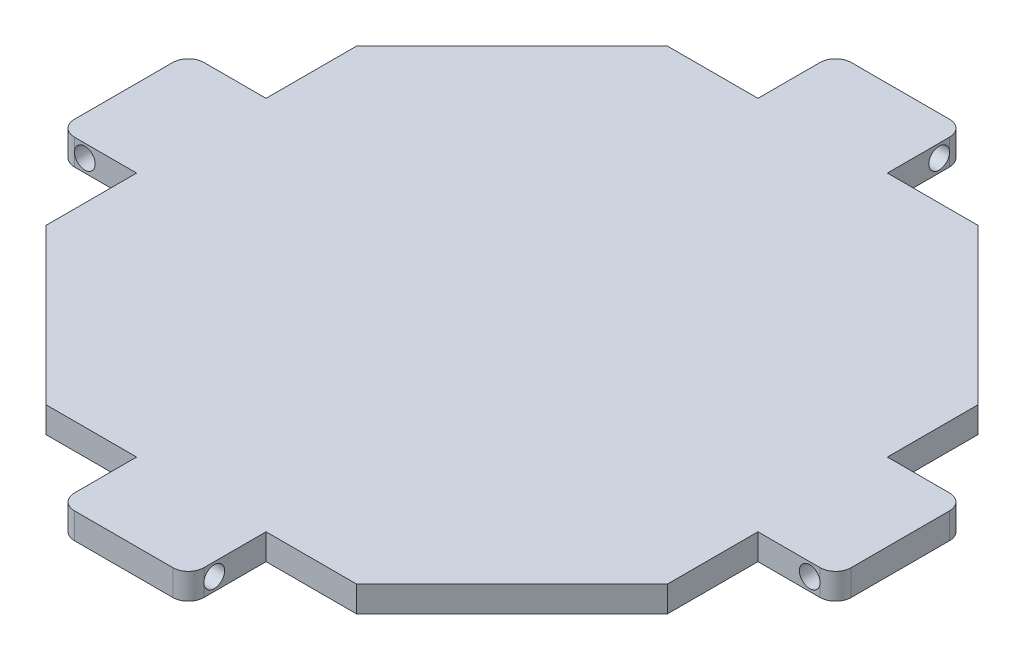
ISO-10303-21;
HEADER;
FILE_DESCRIPTION(('STEP AP214'),'2;1');
FILE_NAME('part.step','',(''),(''),'','','');
FILE_SCHEMA(('AUTOMOTIVE_DESIGN { 1 0 10303 214 1 1 1 1 }'));
ENDSEC;
DATA;
#1=APPLICATION_CONTEXT('core data for automotive mechanical design processes');
#2=APPLICATION_PROTOCOL_DEFINITION('international standard','automotive_design',2000,#1);
#3=PRODUCT_CONTEXT('',#1,'mechanical');
#4=PRODUCT('Part','Part','',(#3));
#5=PRODUCT_RELATED_PRODUCT_CATEGORY('part','',(#4));
#6=PRODUCT_DEFINITION_FORMATION('','',#4);
#7=PRODUCT_DEFINITION_CONTEXT('part definition',#1,'design');
#8=PRODUCT_DEFINITION('design','',#6,#7);
#9=PRODUCT_DEFINITION_SHAPE('','',#8);
#10=(LENGTH_UNIT() NAMED_UNIT(*) SI_UNIT(.MILLI.,.METRE.));
#11=(NAMED_UNIT(*) PLANE_ANGLE_UNIT() SI_UNIT($,.RADIAN.));
#12=(NAMED_UNIT(*) SI_UNIT($,.STERADIAN.) SOLID_ANGLE_UNIT());
#13=UNCERTAINTY_MEASURE_WITH_UNIT(LENGTH_MEASURE(1.E-05),#10,'distance_accuracy_value','');
#14=(GEOMETRIC_REPRESENTATION_CONTEXT(3) GLOBAL_UNCERTAINTY_ASSIGNED_CONTEXT((#13)) GLOBAL_UNIT_ASSIGNED_CONTEXT((#10,
#11,#12)) REPRESENTATION_CONTEXT('',''));
#15=CARTESIAN_POINT('',(0.,0.,0.));
#16=DIRECTION('',(0.,0.,1.));
#17=DIRECTION('',(1.,0.,0.));
#18=AXIS2_PLACEMENT_3D('',#15,#16,#17);
#19=CARTESIAN_POINT('',(-60.,5.,0.));
#20=DIRECTION('',(1.,0.,0.));
#21=DIRECTION('',(0.,0.,-1.));
#22=AXIS2_PLACEMENT_3D('',#19,#20,#21);
#23=PLANE('',#22);
#24=DIRECTION('',(0.,0.,1.));
#25=VECTOR('',#24,1.);
#26=CARTESIAN_POINT('',(-60.,0.,0.));
#27=LINE('',#26,#25);
#28=CARTESIAN_POINT('',(-60.,0.,-30.));
#29=VERTEX_POINT('',#28);
#30=CARTESIAN_POINT('',(-60.,0.,-12.5));
#31=VERTEX_POINT('',#30);
#32=EDGE_CURVE('E294',#29,#31,#27,.T.);
#33=ORIENTED_EDGE('',*,*,#32,.T.);
#34=DIRECTION('',(0.,-1.,0.));
#35=VECTOR('',#34,1.);
#36=CARTESIAN_POINT('',(-60.,5.,-12.5));
#37=LINE('',#36,#35);
#38=CARTESIAN_POINT('',(-60.,5.,-12.5));
#39=VERTEX_POINT('',#38);
#40=EDGE_CURVE('E272',#39,#31,#37,.T.);
#41=ORIENTED_EDGE('',*,*,#40,.F.);
#42=DIRECTION('',(0.,0.,1.));
#43=VECTOR('',#42,1.);
#44=CARTESIAN_POINT('',(-60.,5.,0.));
#45=LINE('',#44,#43);
#46=CARTESIAN_POINT('',(-60.,5.,-30.));
#47=VERTEX_POINT('',#46);
#48=EDGE_CURVE('E280',#47,#39,#45,.T.);
#49=ORIENTED_EDGE('',*,*,#48,.F.);
#50=DIRECTION('',(0.,-1.,0.));
#51=VECTOR('',#50,1.);
#52=CARTESIAN_POINT('',(-60.,5.,-30.));
#53=LINE('',#52,#51);
#54=EDGE_CURVE('E448',#47,#29,#53,.T.);
#55=ORIENTED_EDGE('',*,*,#54,.T.);
#56=EDGE_LOOP('',(#33,#41,#49,#55));
#57=FACE_BOUND('',#56,.T.);
#58=ADVANCED_FACE('F35',(#57),#23,.F.);
#59=CARTESIAN_POINT('',(0.,5.,-12.5));
#60=DIRECTION('',(0.,0.,1.));
#61=DIRECTION('',(1.,0.,0.));
#62=AXIS2_PLACEMENT_3D('',#59,#60,#61);
#63=PLANE('',#62);
#64=DIRECTION('',(0.,-1.,0.));
#65=VECTOR('',#64,1.);
#66=CARTESIAN_POINT('',(-72.,5.,-12.5));
#67=LINE('',#66,#65);
#68=CARTESIAN_POINT('',(-72.,0.,-12.5));
#69=VERTEX_POINT('',#68);
#70=CARTESIAN_POINT('',(-72.,2.5,-12.5));
#71=VERTEX_POINT('',#70);
#72=EDGE_CURVE('E377',#69,#71,#67,.F.);
#73=ORIENTED_EDGE('',*,*,#72,.T.);
#74=CARTESIAN_POINT('',(-70.,2.5,-12.5));
#75=DIRECTION('',(0.,0.,1.));
#76=DIRECTION('',(1.,0.,0.));
#77=AXIS2_PLACEMENT_3D('',#74,#75,#76);
#78=CIRCLE('',#77,2.);
#79=EDGE_CURVE('E544',#71,#71,#78,.T.);
#80=ORIENTED_EDGE('',*,*,#79,.T.);
#81=CARTESIAN_POINT('',(-72.,5.,-12.5));
#82=VERTEX_POINT('',#81);
#83=EDGE_CURVE('E276',#71,#82,#67,.F.);
#84=ORIENTED_EDGE('',*,*,#83,.T.);
#85=DIRECTION('',(-1.,0.,0.));
#86=VECTOR('',#85,1.);
#87=CARTESIAN_POINT('',(0.,5.,-12.5));
#88=LINE('',#87,#86);
#89=EDGE_CURVE('E266',#39,#82,#88,.T.);
#90=ORIENTED_EDGE('',*,*,#89,.F.);
#91=ORIENTED_EDGE('',*,*,#40,.T.);
#92=DIRECTION('',(-1.,0.,0.));
#93=VECTOR('',#92,1.);
#94=CARTESIAN_POINT('',(0.,0.,-12.5));
#95=LINE('',#94,#93);
#96=EDGE_CURVE('E404',#31,#69,#95,.T.);
#97=ORIENTED_EDGE('',*,*,#96,.T.);
#98=EDGE_LOOP('',(#73,#80,#84,#90,#91,#97));
#99=FACE_BOUND('',#98,.T.);
#100=ADVANCED_FACE('F269',(#99),#63,.F.);
#101=CARTESIAN_POINT('',(-75.,5.,0.));
#102=DIRECTION('',(1.,0.,0.));
#103=DIRECTION('',(0.,0.,-1.));
#104=AXIS2_PLACEMENT_3D('',#101,#102,#103);
#105=PLANE('',#104);
#106=DIRECTION('',(0.,0.,1.));
#107=VECTOR('',#106,1.);
#108=CARTESIAN_POINT('',(-75.,5.,0.));
#109=LINE('',#108,#107);
#110=CARTESIAN_POINT('',(-75.,5.,-9.49999999999998));
#111=VERTEX_POINT('',#110);
#112=CARTESIAN_POINT('',(-75.,5.,9.50000000000003));
#113=VERTEX_POINT('',#112);
#114=EDGE_CURVE('E279',#111,#113,#109,.T.);
#115=ORIENTED_EDGE('',*,*,#114,.F.);
#116=DIRECTION('',(0.,-1.,0.));
#117=VECTOR('',#116,1.);
#118=CARTESIAN_POINT('',(-75.,5.,-9.49999999999998));
#119=LINE('',#118,#117);
#120=CARTESIAN_POINT('',(-75.,0.,-9.49999999999998));
#121=VERTEX_POINT('',#120);
#122=EDGE_CURVE('E375',#111,#121,#119,.T.);
#123=ORIENTED_EDGE('',*,*,#122,.T.);
#124=DIRECTION('',(0.,0.,1.));
#125=VECTOR('',#124,1.);
#126=CARTESIAN_POINT('',(-75.,0.,0.));
#127=LINE('',#126,#125);
#128=CARTESIAN_POINT('',(-75.,0.,9.50000000000003));
#129=VERTEX_POINT('',#128);
#130=EDGE_CURVE('E400',#121,#129,#127,.T.);
#131=ORIENTED_EDGE('',*,*,#130,.T.);
#132=DIRECTION('',(0.,-1.,0.));
#133=VECTOR('',#132,1.);
#134=CARTESIAN_POINT('',(-75.,5.,9.50000000000003));
#135=LINE('',#134,#133);
#136=EDGE_CURVE('E373',#129,#113,#135,.F.);
#137=ORIENTED_EDGE('',*,*,#136,.T.);
#138=EDGE_LOOP('',(#115,#123,#131,#137));
#139=FACE_BOUND('',#138,.T.);
#140=ADVANCED_FACE('F551',(#139),#105,.F.);
#141=CARTESIAN_POINT('',(0.,5.,12.5));
#142=DIRECTION('',(0.,0.,-1.));
#143=DIRECTION('',(-1.,0.,0.));
#144=AXIS2_PLACEMENT_3D('',#141,#142,#143);
#145=PLANE('',#144);
#146=DIRECTION('',(0.,-1.,0.));
#147=VECTOR('',#146,1.);
#148=CARTESIAN_POINT('',(-72.,5.,12.5));
#149=LINE('',#148,#147);
#150=CARTESIAN_POINT('',(-72.,5.,12.5));
#151=VERTEX_POINT('',#150);
#152=CARTESIAN_POINT('',(-72.,2.5,12.5));
#153=VERTEX_POINT('',#152);
#154=EDGE_CURVE('E11',#151,#153,#149,.T.);
#155=ORIENTED_EDGE('',*,*,#154,.T.);
#156=CARTESIAN_POINT('',(-70.,2.5,12.5));
#157=DIRECTION('',(0.,0.,1.));
#158=DIRECTION('',(1.,0.,0.));
#159=AXIS2_PLACEMENT_3D('',#156,#157,#158);
#160=CIRCLE('',#159,2.);
#161=EDGE_CURVE('E387',#153,#153,#160,.T.);
#162=ORIENTED_EDGE('',*,*,#161,.F.);
#163=CARTESIAN_POINT('',(-72.,0.,12.5));
#164=VERTEX_POINT('',#163);
#165=EDGE_CURVE('E43',#153,#164,#149,.T.);
#166=ORIENTED_EDGE('',*,*,#165,.T.);
#167=DIRECTION('',(1.,0.,0.));
#168=VECTOR('',#167,1.);
#169=CARTESIAN_POINT('',(0.,0.,12.5));
#170=LINE('',#169,#168);
#171=CARTESIAN_POINT('',(-60.,0.,12.5));
#172=VERTEX_POINT('',#171);
#173=EDGE_CURVE('E386',#164,#172,#170,.T.);
#174=ORIENTED_EDGE('',*,*,#173,.T.);
#175=DIRECTION('',(0.,-1.,0.));
#176=VECTOR('',#175,1.);
#177=CARTESIAN_POINT('',(-60.,5.,12.5));
#178=LINE('',#177,#176);
#179=CARTESIAN_POINT('',(-60.,5.,12.5));
#180=VERTEX_POINT('',#179);
#181=EDGE_CURVE('E296',#180,#172,#178,.T.);
#182=ORIENTED_EDGE('',*,*,#181,.F.);
#183=DIRECTION('',(1.,0.,0.));
#184=VECTOR('',#183,1.);
#185=CARTESIAN_POINT('',(0.,5.,12.5));
#186=LINE('',#185,#184);
#187=EDGE_CURVE('E552',#151,#180,#186,.T.);
#188=ORIENTED_EDGE('',*,*,#187,.F.);
#189=EDGE_LOOP('',(#155,#162,#166,#174,#182,#188));
#190=FACE_BOUND('',#189,.T.);
#191=ADVANCED_FACE('F383',(#190),#145,.F.);
#192=CARTESIAN_POINT('',(-60.,0.,30.));
#193=VERTEX_POINT('',#192);
#194=EDGE_CURVE('E399',#172,#193,#27,.T.);
#195=ORIENTED_EDGE('',*,*,#194,.T.);
#196=DIRECTION('',(0.,-1.,0.));
#197=VECTOR('',#196,1.);
#198=CARTESIAN_POINT('',(-60.,5.,30.));
#199=LINE('',#198,#197);
#200=CARTESIAN_POINT('',(-60.,5.,30.));
#201=VERTEX_POINT('',#200);
#202=EDGE_CURVE('E301',#201,#193,#199,.T.);
#203=ORIENTED_EDGE('',*,*,#202,.F.);
#204=EDGE_CURVE('E292',#180,#201,#45,.T.);
#205=ORIENTED_EDGE('',*,*,#204,.F.);
#206=ORIENTED_EDGE('',*,*,#181,.T.);
#207=EDGE_LOOP('',(#195,#203,#205,#206));
#208=FACE_BOUND('',#207,.T.);
#209=ADVANCED_FACE('F607',(#208),#23,.F.);
#210=CARTESIAN_POINT('',(-45.,5.,45.));
#211=DIRECTION('',(0.707106781186547,0.,-0.707106781186548));
#212=DIRECTION('',(-0.707106781186548,0.,-0.707106781186547));
#213=AXIS2_PLACEMENT_3D('',#210,#211,#212);
#214=PLANE('',#213);
#215=DIRECTION('',(0.707106781186548,0.,0.707106781186547));
#216=VECTOR('',#215,1.);
#217=CARTESIAN_POINT('',(-45.,0.,45.));
#218=LINE('',#217,#216);
#219=CARTESIAN_POINT('',(-30.,0.,60.));
#220=VERTEX_POINT('',#219);
#221=EDGE_CURVE('E402',#193,#220,#218,.T.);
#222=ORIENTED_EDGE('',*,*,#221,.T.);
#223=DIRECTION('',(0.,-1.,0.));
#224=VECTOR('',#223,1.);
#225=CARTESIAN_POINT('',(-30.,5.,60.));
#226=LINE('',#225,#224);
#227=CARTESIAN_POINT('',(-30.,5.,60.));
#228=VERTEX_POINT('',#227);
#229=EDGE_CURVE('E482',#228,#220,#226,.T.);
#230=ORIENTED_EDGE('',*,*,#229,.F.);
#231=DIRECTION('',(0.707106781186548,0.,0.707106781186547));
#232=VECTOR('',#231,1.);
#233=CARTESIAN_POINT('',(-45.,5.,45.));
#234=LINE('',#233,#232);
#235=EDGE_CURVE('E490',#201,#228,#234,.T.);
#236=ORIENTED_EDGE('',*,*,#235,.F.);
#237=ORIENTED_EDGE('',*,*,#202,.T.);
#238=EDGE_LOOP('',(#222,#230,#236,#237));
#239=FACE_BOUND('',#238,.T.);
#240=ADVANCED_FACE('F488',(#239),#214,.F.);
#241=CARTESIAN_POINT('',(0.,5.,60.));
#242=DIRECTION('',(0.,0.,-1.));
#243=DIRECTION('',(-1.,0.,0.));
#244=AXIS2_PLACEMENT_3D('',#241,#242,#243);
#245=PLANE('',#244);
#246=DIRECTION('',(1.,0.,0.));
#247=VECTOR('',#246,1.);
#248=CARTESIAN_POINT('',(0.,0.,60.));
#249=LINE('',#248,#247);
#250=CARTESIAN_POINT('',(-12.5,0.,60.));
#251=VERTEX_POINT('',#250);
#252=EDGE_CURVE('E409',#220,#251,#249,.T.);
#253=ORIENTED_EDGE('',*,*,#252,.T.);
#254=DIRECTION('',(0.,-1.,0.));
#255=VECTOR('',#254,1.);
#256=CARTESIAN_POINT('',(-12.5,5.,60.));
#257=LINE('',#256,#255);
#258=CARTESIAN_POINT('',(-12.5,5.,60.));
#259=VERTEX_POINT('',#258);
#260=EDGE_CURVE('E479',#259,#251,#257,.T.);
#261=ORIENTED_EDGE('',*,*,#260,.F.);
#262=DIRECTION('',(1.,0.,0.));
#263=VECTOR('',#262,1.);
#264=CARTESIAN_POINT('',(0.,5.,60.));
#265=LINE('',#264,#263);
#266=EDGE_CURVE('E508',#228,#259,#265,.T.);
#267=ORIENTED_EDGE('',*,*,#266,.F.);
#268=ORIENTED_EDGE('',*,*,#229,.T.);
#269=EDGE_LOOP('',(#253,#261,#267,#268));
#270=FACE_BOUND('',#269,.T.);
#271=ADVANCED_FACE('F497',(#270),#245,.F.);
#272=CARTESIAN_POINT('',(-12.5,5.,0.));
#273=DIRECTION('',(1.,0.,0.));
#274=DIRECTION('',(0.,0.,-1.));
#275=AXIS2_PLACEMENT_3D('',#272,#273,#274);
#276=PLANE('',#275);
#277=DIRECTION('',(0.,-1.,0.));
#278=VECTOR('',#277,1.);
#279=CARTESIAN_POINT('',(-12.5,5.,72.));
#280=LINE('',#279,#278);
#281=CARTESIAN_POINT('',(-12.5,0.,72.));
#282=VERTEX_POINT('',#281);
#283=CARTESIAN_POINT('',(-12.5,2.5,72.));
#284=VERTEX_POINT('',#283);
#285=EDGE_CURVE('E344',#282,#284,#280,.F.);
#286=ORIENTED_EDGE('',*,*,#285,.T.);
#287=CARTESIAN_POINT('',(-12.5,2.5,70.));
#288=DIRECTION('',(-1.,0.,0.));
#289=DIRECTION('',(0.,0.,1.));
#290=AXIS2_PLACEMENT_3D('',#287,#288,#289);
#291=CIRCLE('',#290,2.);
#292=EDGE_CURVE('E53',#284,#284,#291,.T.);
#293=ORIENTED_EDGE('',*,*,#292,.F.);
#294=CARTESIAN_POINT('',(-12.5,5.,72.));
#295=VERTEX_POINT('',#294);
#296=EDGE_CURVE('E343',#284,#295,#280,.F.);
#297=ORIENTED_EDGE('',*,*,#296,.T.);
#298=DIRECTION('',(0.,0.,1.));
#299=VECTOR('',#298,1.);
#300=CARTESIAN_POINT('',(-12.5,5.,0.));
#301=LINE('',#300,#299);
#302=EDGE_CURVE('E504',#259,#295,#301,.T.);
#303=ORIENTED_EDGE('',*,*,#302,.F.);
#304=ORIENTED_EDGE('',*,*,#260,.T.);
#305=DIRECTION('',(0.,0.,1.));
#306=VECTOR('',#305,1.);
#307=CARTESIAN_POINT('',(-12.5,0.,0.));
#308=LINE('',#307,#306);
#309=EDGE_CURVE('E411',#251,#282,#308,.T.);
#310=ORIENTED_EDGE('',*,*,#309,.T.);
#311=EDGE_LOOP('',(#286,#293,#297,#303,#304,#310));
#312=FACE_BOUND('',#311,.T.);
#313=ADVANCED_FACE('F501',(#312),#276,.F.);
#314=CARTESIAN_POINT('',(0.,5.,75.));
#315=DIRECTION('',(0.,0.,-1.));
#316=DIRECTION('',(-1.,0.,0.));
#317=AXIS2_PLACEMENT_3D('',#314,#315,#316);
#318=PLANE('',#317);
#319=DIRECTION('',(1.,0.,0.));
#320=VECTOR('',#319,1.);
#321=CARTESIAN_POINT('',(0.,0.,75.));
#322=LINE('',#321,#320);
#323=CARTESIAN_POINT('',(-9.50000000000002,0.,75.));
#324=VERTEX_POINT('',#323);
#325=CARTESIAN_POINT('',(9.5,0.,75.));
#326=VERTEX_POINT('',#325);
#327=EDGE_CURVE('E415',#324,#326,#322,.T.);
#328=ORIENTED_EDGE('',*,*,#327,.T.);
#329=DIRECTION('',(0.,-1.,0.));
#330=VECTOR('',#329,1.);
#331=CARTESIAN_POINT('',(9.5,5.,75.));
#332=LINE('',#331,#330);
#333=CARTESIAN_POINT('',(9.5,5.,75.));
#334=VERTEX_POINT('',#333);
#335=EDGE_CURVE('E325',#326,#334,#332,.F.);
#336=ORIENTED_EDGE('',*,*,#335,.T.);
#337=DIRECTION('',(1.,0.,0.));
#338=VECTOR('',#337,1.);
#339=CARTESIAN_POINT('',(0.,5.,75.));
#340=LINE('',#339,#338);
#341=CARTESIAN_POINT('',(-9.50000000000002,5.,75.));
#342=VERTEX_POINT('',#341);
#343=EDGE_CURVE('E507',#342,#334,#340,.T.);
#344=ORIENTED_EDGE('',*,*,#343,.F.);
#345=DIRECTION('',(0.,-1.,0.));
#346=VECTOR('',#345,1.);
#347=CARTESIAN_POINT('',(-9.50000000000002,5.,75.));
#348=LINE('',#347,#346);
#349=EDGE_CURVE('E322',#342,#324,#348,.T.);
#350=ORIENTED_EDGE('',*,*,#349,.T.);
#351=EDGE_LOOP('',(#328,#336,#344,#350));
#352=FACE_BOUND('',#351,.T.);
#353=ADVANCED_FACE('F591',(#352),#318,.F.);
#354=CARTESIAN_POINT('',(12.5,5.,0.));
#355=DIRECTION('',(-1.,0.,0.));
#356=DIRECTION('',(0.,0.,1.));
#357=AXIS2_PLACEMENT_3D('',#354,#355,#356);
#358=PLANE('',#357);
#359=DIRECTION('',(0.,-1.,0.));
#360=VECTOR('',#359,1.);
#361=CARTESIAN_POINT('',(12.5,5.,72.));
#362=LINE('',#361,#360);
#363=CARTESIAN_POINT('',(12.5,5.,72.));
#364=VERTEX_POINT('',#363);
#365=CARTESIAN_POINT('',(12.5,2.5,72.));
#366=VERTEX_POINT('',#365);
#367=EDGE_CURVE('E298',#364,#366,#362,.T.);
#368=ORIENTED_EDGE('',*,*,#367,.T.);
#369=CARTESIAN_POINT('',(12.5,2.5,70.));
#370=DIRECTION('',(-1.,0.,0.));
#371=DIRECTION('',(0.,0.,1.));
#372=AXIS2_PLACEMENT_3D('',#369,#370,#371);
#373=CIRCLE('',#372,2.);
#374=EDGE_CURVE('E48',#366,#366,#373,.T.);
#375=ORIENTED_EDGE('',*,*,#374,.T.);
#376=CARTESIAN_POINT('',(12.5,0.,72.));
#377=VERTEX_POINT('',#376);
#378=EDGE_CURVE('E295',#366,#377,#362,.T.);
#379=ORIENTED_EDGE('',*,*,#378,.T.);
#380=DIRECTION('',(0.,0.,-1.));
#381=VECTOR('',#380,1.);
#382=CARTESIAN_POINT('',(12.5,0.,0.));
#383=LINE('',#382,#381);
#384=CARTESIAN_POINT('',(12.5,0.,60.));
#385=VERTEX_POINT('',#384);
#386=EDGE_CURVE('E418',#377,#385,#383,.T.);
#387=ORIENTED_EDGE('',*,*,#386,.T.);
#388=DIRECTION('',(0.,-1.,0.));
#389=VECTOR('',#388,1.);
#390=CARTESIAN_POINT('',(12.5,5.,60.));
#391=LINE('',#390,#389);
#392=CARTESIAN_POINT('',(12.5,5.,60.));
#393=VERTEX_POINT('',#392);
#394=EDGE_CURVE('E476',#393,#385,#391,.T.);
#395=ORIENTED_EDGE('',*,*,#394,.F.);
#396=DIRECTION('',(0.,0.,-1.));
#397=VECTOR('',#396,1.);
#398=CARTESIAN_POINT('',(12.5,5.,0.));
#399=LINE('',#398,#397);
#400=EDGE_CURVE('E510',#364,#393,#399,.T.);
#401=ORIENTED_EDGE('',*,*,#400,.F.);
#402=EDGE_LOOP('',(#368,#375,#379,#387,#395,#401));
#403=FACE_BOUND('',#402,.T.);
#404=ADVANCED_FACE('F570',(#403),#358,.F.);
#405=CARTESIAN_POINT('',(30.,0.,60.));
#406=VERTEX_POINT('',#405);
#407=EDGE_CURVE('E412',#385,#406,#249,.T.);
#408=ORIENTED_EDGE('',*,*,#407,.T.);
#409=DIRECTION('',(0.,-1.,0.));
#410=VECTOR('',#409,1.);
#411=CARTESIAN_POINT('',(30.,5.,60.));
#412=LINE('',#411,#410);
#413=CARTESIAN_POINT('',(30.,5.,60.));
#414=VERTEX_POINT('',#413);
#415=EDGE_CURVE('E473',#414,#406,#412,.T.);
#416=ORIENTED_EDGE('',*,*,#415,.F.);
#417=EDGE_CURVE('E513',#393,#414,#265,.T.);
#418=ORIENTED_EDGE('',*,*,#417,.F.);
#419=ORIENTED_EDGE('',*,*,#394,.T.);
#420=EDGE_LOOP('',(#408,#416,#418,#419));
#421=FACE_BOUND('',#420,.T.);
#422=ADVANCED_FACE('F584',(#421),#245,.F.);
#423=CARTESIAN_POINT('',(45.,5.,45.));
#424=DIRECTION('',(-0.707106781186547,0.,-0.707106781186548));
#425=DIRECTION('',(-0.707106781186548,0.,0.707106781186547));
#426=AXIS2_PLACEMENT_3D('',#423,#424,#425);
#427=PLANE('',#426);
#428=DIRECTION('',(0.707106781186548,0.,-0.707106781186547));
#429=VECTOR('',#428,1.);
#430=CARTESIAN_POINT('',(45.,0.,45.));
#431=LINE('',#430,#429);
#432=CARTESIAN_POINT('',(60.,0.,30.));
#433=VERTEX_POINT('',#432);
#434=EDGE_CURVE('E420',#406,#433,#431,.T.);
#435=ORIENTED_EDGE('',*,*,#434,.T.);
#436=DIRECTION('',(0.,-1.,0.));
#437=VECTOR('',#436,1.);
#438=CARTESIAN_POINT('',(60.,5.,30.));
#439=LINE('',#438,#437);
#440=CARTESIAN_POINT('',(60.,5.,30.));
#441=VERTEX_POINT('',#440);
#442=EDGE_CURVE('E470',#441,#433,#439,.T.);
#443=ORIENTED_EDGE('',*,*,#442,.F.);
#444=DIRECTION('',(0.707106781186548,0.,-0.707106781186547));
#445=VECTOR('',#444,1.);
#446=CARTESIAN_POINT('',(45.,5.,45.));
#447=LINE('',#446,#445);
#448=EDGE_CURVE('E517',#414,#441,#447,.T.);
#449=ORIENTED_EDGE('',*,*,#448,.F.);
#450=ORIENTED_EDGE('',*,*,#415,.T.);
#451=EDGE_LOOP('',(#435,#443,#449,#450));
#452=FACE_BOUND('',#451,.T.);
#453=ADVANCED_FACE('F845',(#452),#427,.F.);
#454=CARTESIAN_POINT('',(60.,5.,0.));
#455=DIRECTION('',(-1.,0.,0.));
#456=DIRECTION('',(0.,0.,1.));
#457=AXIS2_PLACEMENT_3D('',#454,#455,#456);
#458=PLANE('',#457);
#459=DIRECTION('',(0.,0.,-1.));
#460=VECTOR('',#459,1.);
#461=CARTESIAN_POINT('',(60.,0.,0.));
#462=LINE('',#461,#460);
#463=CARTESIAN_POINT('',(60.,0.,12.5));
#464=VERTEX_POINT('',#463);
#465=EDGE_CURVE('E422',#433,#464,#462,.T.);
#466=ORIENTED_EDGE('',*,*,#465,.T.);
#467=DIRECTION('',(0.,-1.,0.));
#468=VECTOR('',#467,1.);
#469=CARTESIAN_POINT('',(60.,5.,12.5));
#470=LINE('',#469,#468);
#471=CARTESIAN_POINT('',(60.,5.,12.5));
#472=VERTEX_POINT('',#471);
#473=EDGE_CURVE('E467',#472,#464,#470,.T.);
#474=ORIENTED_EDGE('',*,*,#473,.F.);
#475=DIRECTION('',(0.,0.,-1.));
#476=VECTOR('',#475,1.);
#477=CARTESIAN_POINT('',(60.,5.,0.));
#478=LINE('',#477,#476);
#479=EDGE_CURVE('E519',#441,#472,#478,.T.);
#480=ORIENTED_EDGE('',*,*,#479,.F.);
#481=ORIENTED_EDGE('',*,*,#442,.T.);
#482=EDGE_LOOP('',(#466,#474,#480,#481));
#483=FACE_BOUND('',#482,.T.);
#484=ADVANCED_FACE('F654',(#483),#458,.F.);
#485=CARTESIAN_POINT('',(0.,5.,12.5));
#486=DIRECTION('',(0.,0.,-1.));
#487=DIRECTION('',(-1.,0.,0.));
#488=AXIS2_PLACEMENT_3D('',#485,#486,#487);
#489=PLANE('',#488);
#490=DIRECTION('',(0.,-1.,0.));
#491=VECTOR('',#490,1.);
#492=CARTESIAN_POINT('',(72.,5.,12.5));
#493=LINE('',#492,#491);
#494=CARTESIAN_POINT('',(72.,0.,12.5));
#495=VERTEX_POINT('',#494);
#496=CARTESIAN_POINT('',(72.,2.5,12.5));
#497=VERTEX_POINT('',#496);
#498=EDGE_CURVE('E353',#495,#497,#493,.F.);
#499=ORIENTED_EDGE('',*,*,#498,.T.);
#500=CARTESIAN_POINT('',(70.,2.5,12.5));
#501=DIRECTION('',(0.,0.,1.));
#502=DIRECTION('',(1.,0.,0.));
#503=AXIS2_PLACEMENT_3D('',#500,#501,#502);
#504=CIRCLE('',#503,1.99999999999998);
#505=EDGE_CURVE('E561',#497,#497,#504,.T.);
#506=ORIENTED_EDGE('',*,*,#505,.F.);
#507=CARTESIAN_POINT('',(72.,5.,12.5));
#508=VERTEX_POINT('',#507);
#509=EDGE_CURVE('E352',#497,#508,#493,.F.);
#510=ORIENTED_EDGE('',*,*,#509,.T.);
#511=DIRECTION('',(1.,0.,0.));
#512=VECTOR('',#511,1.);
#513=CARTESIAN_POINT('',(0.,5.,12.5));
#514=LINE('',#513,#512);
#515=EDGE_CURVE('E521',#472,#508,#514,.T.);
#516=ORIENTED_EDGE('',*,*,#515,.F.);
#517=ORIENTED_EDGE('',*,*,#473,.T.);
#518=DIRECTION('',(1.,0.,0.));
#519=VECTOR('',#518,1.);
#520=CARTESIAN_POINT('',(0.,0.,12.5));
#521=LINE('',#520,#519);
#522=EDGE_CURVE('E424',#464,#495,#521,.T.);
#523=ORIENTED_EDGE('',*,*,#522,.T.);
#524=EDGE_LOOP('',(#499,#506,#510,#516,#517,#523));
#525=FACE_BOUND('',#524,.T.);
#526=ADVANCED_FACE('F648',(#525),#489,.F.);
#527=CARTESIAN_POINT('',(75.,5.,0.));
#528=DIRECTION('',(-1.,0.,0.));
#529=DIRECTION('',(0.,0.,1.));
#530=AXIS2_PLACEMENT_3D('',#527,#528,#529);
#531=PLANE('',#530);
#532=DIRECTION('',(0.,0.,-1.));
#533=VECTOR('',#532,1.);
#534=CARTESIAN_POINT('',(75.,5.,0.));
#535=LINE('',#534,#533);
#536=CARTESIAN_POINT('',(75.,5.,9.5));
#537=VERTEX_POINT('',#536);
#538=CARTESIAN_POINT('',(75.,5.,-9.50000000000001));
#539=VERTEX_POINT('',#538);
#540=EDGE_CURVE('E525',#537,#539,#535,.T.);
#541=ORIENTED_EDGE('',*,*,#540,.F.);
#542=DIRECTION('',(0.,-1.,0.));
#543=VECTOR('',#542,1.);
#544=CARTESIAN_POINT('',(75.,5.,9.5));
#545=LINE('',#544,#543);
#546=CARTESIAN_POINT('',(75.,0.,9.5));
#547=VERTEX_POINT('',#546);
#548=EDGE_CURVE('E349',#537,#547,#545,.T.);
#549=ORIENTED_EDGE('',*,*,#548,.T.);
#550=DIRECTION('',(0.,0.,-1.));
#551=VECTOR('',#550,1.);
#552=CARTESIAN_POINT('',(75.,0.,0.));
#553=LINE('',#552,#551);
#554=CARTESIAN_POINT('',(75.,0.,-9.50000000000001));
#555=VERTEX_POINT('',#554);
#556=EDGE_CURVE('E428',#547,#555,#553,.T.);
#557=ORIENTED_EDGE('',*,*,#556,.T.);
#558=DIRECTION('',(0.,-1.,0.));
#559=VECTOR('',#558,1.);
#560=CARTESIAN_POINT('',(75.,5.,-9.50000000000001));
#561=LINE('',#560,#559);
#562=EDGE_CURVE('E347',#555,#539,#561,.F.);
#563=ORIENTED_EDGE('',*,*,#562,.T.);
#564=EDGE_LOOP('',(#541,#549,#557,#563));
#565=FACE_BOUND('',#564,.T.);
#566=ADVANCED_FACE('F653',(#565),#531,.F.);
#567=CARTESIAN_POINT('',(0.,5.,-12.5));
#568=DIRECTION('',(0.,0.,1.));
#569=DIRECTION('',(1.,0.,0.));
#570=AXIS2_PLACEMENT_3D('',#567,#568,#569);
#571=PLANE('',#570);
#572=DIRECTION('',(0.,-1.,0.));
#573=VECTOR('',#572,1.);
#574=CARTESIAN_POINT('',(72.,5.,-12.5));
#575=LINE('',#574,#573);
#576=CARTESIAN_POINT('',(72.,5.,-12.5));
#577=VERTEX_POINT('',#576);
#578=CARTESIAN_POINT('',(72.,2.5,-12.5));
#579=VERTEX_POINT('',#578);
#580=EDGE_CURVE('E357',#577,#579,#575,.T.);
#581=ORIENTED_EDGE('',*,*,#580,.T.);
#582=CARTESIAN_POINT('',(70.,2.5,-12.5));
#583=DIRECTION('',(0.,0.,1.));
#584=DIRECTION('',(1.,0.,0.));
#585=AXIS2_PLACEMENT_3D('',#582,#583,#584);
#586=CIRCLE('',#585,1.99999999999998);
#587=EDGE_CURVE('E558',#579,#579,#586,.T.);
#588=ORIENTED_EDGE('',*,*,#587,.T.);
#589=CARTESIAN_POINT('',(72.,0.,-12.5));
#590=VERTEX_POINT('',#589);
#591=EDGE_CURVE('E356',#579,#590,#575,.T.);
#592=ORIENTED_EDGE('',*,*,#591,.T.);
#593=DIRECTION('',(-1.,0.,0.));
#594=VECTOR('',#593,1.);
#595=CARTESIAN_POINT('',(0.,0.,-12.5));
#596=LINE('',#595,#594);
#597=CARTESIAN_POINT('',(60.,0.,-12.5));
#598=VERTEX_POINT('',#597);
#599=EDGE_CURVE('E431',#590,#598,#596,.T.);
#600=ORIENTED_EDGE('',*,*,#599,.T.);
#601=DIRECTION('',(0.,-1.,0.));
#602=VECTOR('',#601,1.);
#603=CARTESIAN_POINT('',(60.,5.,-12.5));
#604=LINE('',#603,#602);
#605=CARTESIAN_POINT('',(60.,5.,-12.5));
#606=VERTEX_POINT('',#605);
#607=EDGE_CURVE('E464',#606,#598,#604,.T.);
#608=ORIENTED_EDGE('',*,*,#607,.F.);
#609=DIRECTION('',(-1.,0.,0.));
#610=VECTOR('',#609,1.);
#611=CARTESIAN_POINT('',(0.,5.,-12.5));
#612=LINE('',#611,#610);
#613=EDGE_CURVE('E528',#577,#606,#612,.T.);
#614=ORIENTED_EDGE('',*,*,#613,.F.);
#615=EDGE_LOOP('',(#581,#588,#592,#600,#608,#614));
#616=FACE_BOUND('',#615,.T.);
#617=ADVANCED_FACE('F664',(#616),#571,.F.);
#618=CARTESIAN_POINT('',(60.,0.,-30.));
#619=VERTEX_POINT('',#618);
#620=EDGE_CURVE('E425',#598,#619,#462,.T.);
#621=ORIENTED_EDGE('',*,*,#620,.T.);
#622=DIRECTION('',(0.,-1.,0.));
#623=VECTOR('',#622,1.);
#624=CARTESIAN_POINT('',(60.,5.,-30.));
#625=LINE('',#624,#623);
#626=CARTESIAN_POINT('',(60.,5.,-30.));
#627=VERTEX_POINT('',#626);
#628=EDGE_CURVE('E461',#627,#619,#625,.T.);
#629=ORIENTED_EDGE('',*,*,#628,.F.);
#630=EDGE_CURVE('E522',#606,#627,#478,.T.);
#631=ORIENTED_EDGE('',*,*,#630,.F.);
#632=ORIENTED_EDGE('',*,*,#607,.T.);
#633=EDGE_LOOP('',(#621,#629,#631,#632));
#634=FACE_BOUND('',#633,.T.);
#635=ADVANCED_FACE('F669',(#634),#458,.F.);
#636=CARTESIAN_POINT('',(45.,5.,-45.));
#637=DIRECTION('',(-0.707106781186548,0.,0.707106781186548));
#638=DIRECTION('',(0.707106781186548,0.,0.707106781186548));
#639=AXIS2_PLACEMENT_3D('',#636,#637,#638);
#640=PLANE('',#639);
#641=DIRECTION('',(-0.707106781186548,0.,-0.707106781186548));
#642=VECTOR('',#641,1.);
#643=CARTESIAN_POINT('',(45.,0.,-45.));
#644=LINE('',#643,#642);
#645=CARTESIAN_POINT('',(30.,0.,-60.));
#646=VERTEX_POINT('',#645);
#647=EDGE_CURVE('E433',#619,#646,#644,.T.);
#648=ORIENTED_EDGE('',*,*,#647,.T.);
#649=DIRECTION('',(0.,-1.,0.));
#650=VECTOR('',#649,1.);
#651=CARTESIAN_POINT('',(30.,5.,-60.));
#652=LINE('',#651,#650);
#653=CARTESIAN_POINT('',(30.,5.,-60.));
#654=VERTEX_POINT('',#653);
#655=EDGE_CURVE('E458',#654,#646,#652,.T.);
#656=ORIENTED_EDGE('',*,*,#655,.F.);
#657=DIRECTION('',(-0.707106781186548,0.,-0.707106781186548));
#658=VECTOR('',#657,1.);
#659=CARTESIAN_POINT('',(45.,5.,-45.));
#660=LINE('',#659,#658);
#661=EDGE_CURVE('E530',#627,#654,#660,.T.);
#662=ORIENTED_EDGE('',*,*,#661,.F.);
#663=ORIENTED_EDGE('',*,*,#628,.T.);
#664=EDGE_LOOP('',(#648,#656,#662,#663));
#665=FACE_BOUND('',#664,.T.);
#666=ADVANCED_FACE('F837',(#665),#640,.F.);
#667=CARTESIAN_POINT('',(0.,5.,-60.));
#668=DIRECTION('',(0.,0.,1.));
#669=DIRECTION('',(1.,0.,0.));
#670=AXIS2_PLACEMENT_3D('',#667,#668,#669);
#671=PLANE('',#670);
#672=DIRECTION('',(-1.,0.,0.));
#673=VECTOR('',#672,1.);
#674=CARTESIAN_POINT('',(0.,0.,-60.));
#675=LINE('',#674,#673);
#676=CARTESIAN_POINT('',(12.5,0.,-60.));
#677=VERTEX_POINT('',#676);
#678=EDGE_CURVE('E435',#646,#677,#675,.T.);
#679=ORIENTED_EDGE('',*,*,#678,.T.);
#680=DIRECTION('',(0.,-1.,0.));
#681=VECTOR('',#680,1.);
#682=CARTESIAN_POINT('',(12.5,5.,-60.));
#683=LINE('',#682,#681);
#684=CARTESIAN_POINT('',(12.5,5.,-60.));
#685=VERTEX_POINT('',#684);
#686=EDGE_CURVE('E455',#685,#677,#683,.T.);
#687=ORIENTED_EDGE('',*,*,#686,.F.);
#688=DIRECTION('',(-1.,0.,0.));
#689=VECTOR('',#688,1.);
#690=CARTESIAN_POINT('',(0.,5.,-60.));
#691=LINE('',#690,#689);
#692=EDGE_CURVE('E532',#654,#685,#691,.T.);
#693=ORIENTED_EDGE('',*,*,#692,.F.);
#694=ORIENTED_EDGE('',*,*,#655,.T.);
#695=EDGE_LOOP('',(#679,#687,#693,#694));
#696=FACE_BOUND('',#695,.T.);
#697=ADVANCED_FACE('F764',(#696),#671,.F.);
#698=CARTESIAN_POINT('',(12.5,5.,0.));
#699=DIRECTION('',(1.,0.,0.));
#700=DIRECTION('',(0.,0.,-1.));
#701=AXIS2_PLACEMENT_3D('',#698,#699,#700);
#702=PLANE('',#701);
#703=DIRECTION('',(0.,-1.,0.));
#704=VECTOR('',#703,1.);
#705=CARTESIAN_POINT('',(12.5,5.,-72.));
#706=LINE('',#705,#704);
#707=CARTESIAN_POINT('',(12.5,0.,-72.));
#708=VERTEX_POINT('',#707);
#709=CARTESIAN_POINT('',(12.5,2.5,-72.));
#710=VERTEX_POINT('',#709);
#711=EDGE_CURVE('E366',#708,#710,#706,.F.);
#712=ORIENTED_EDGE('',*,*,#711,.T.);
#713=CARTESIAN_POINT('',(12.5,2.5,-70.));
#714=DIRECTION('',(1.,0.,0.));
#715=DIRECTION('',(0.,0.,-1.));
#716=AXIS2_PLACEMENT_3D('',#713,#714,#715);
#717=CIRCLE('',#716,2.);
#718=EDGE_CURVE('E563',#710,#710,#717,.T.);
#719=ORIENTED_EDGE('',*,*,#718,.F.);
#720=CARTESIAN_POINT('',(12.5,5.,-72.));
#721=VERTEX_POINT('',#720);
#722=EDGE_CURVE('E365',#710,#721,#706,.F.);
#723=ORIENTED_EDGE('',*,*,#722,.T.);
#724=DIRECTION('',(0.,0.,1.));
#725=VECTOR('',#724,1.);
#726=CARTESIAN_POINT('',(12.5,5.,0.));
#727=LINE('',#726,#725);
#728=EDGE_CURVE('E535',#721,#685,#727,.T.);
#729=ORIENTED_EDGE('',*,*,#728,.T.);
#730=ORIENTED_EDGE('',*,*,#686,.T.);
#731=DIRECTION('',(0.,0.,1.));
#732=VECTOR('',#731,1.);
#733=CARTESIAN_POINT('',(12.5,0.,0.));
#734=LINE('',#733,#732);
#735=EDGE_CURVE('E438',#708,#677,#734,.T.);
#736=ORIENTED_EDGE('',*,*,#735,.F.);
#737=EDGE_LOOP('',(#712,#719,#723,#729,#730,#736));
#738=FACE_BOUND('',#737,.T.);
#739=ADVANCED_FACE('F758',(#738),#702,.T.);
#740=CARTESIAN_POINT('',(0.,5.,-75.));
#741=DIRECTION('',(0.,0.,-1.));
#742=DIRECTION('',(-1.,0.,0.));
#743=AXIS2_PLACEMENT_3D('',#740,#741,#742);
#744=PLANE('',#743);
#745=DIRECTION('',(1.,0.,0.));
#746=VECTOR('',#745,1.);
#747=CARTESIAN_POINT('',(0.,5.,-75.));
#748=LINE('',#747,#746);
#749=CARTESIAN_POINT('',(-9.50000000000001,5.,-75.));
#750=VERTEX_POINT('',#749);
#751=CARTESIAN_POINT('',(9.5,5.,-75.));
#752=VERTEX_POINT('',#751);
#753=EDGE_CURVE('E538',#750,#752,#748,.T.);
#754=ORIENTED_EDGE('',*,*,#753,.T.);
#755=DIRECTION('',(0.,-1.,0.));
#756=VECTOR('',#755,1.);
#757=CARTESIAN_POINT('',(9.5,5.,-75.));
#758=LINE('',#757,#756);
#759=CARTESIAN_POINT('',(9.5,0.,-75.));
#760=VERTEX_POINT('',#759);
#761=EDGE_CURVE('E362',#752,#760,#758,.T.);
#762=ORIENTED_EDGE('',*,*,#761,.T.);
#763=DIRECTION('',(1.,0.,0.));
#764=VECTOR('',#763,1.);
#765=CARTESIAN_POINT('',(0.,0.,-75.));
#766=LINE('',#765,#764);
#767=CARTESIAN_POINT('',(-9.50000000000001,0.,-75.));
#768=VERTEX_POINT('',#767);
#769=EDGE_CURVE('E441',#768,#760,#766,.T.);
#770=ORIENTED_EDGE('',*,*,#769,.F.);
#771=DIRECTION('',(0.,-1.,0.));
#772=VECTOR('',#771,1.);
#773=CARTESIAN_POINT('',(-9.50000000000001,5.,-75.));
#774=LINE('',#773,#772);
#775=EDGE_CURVE('E360',#768,#750,#774,.F.);
#776=ORIENTED_EDGE('',*,*,#775,.T.);
#777=EDGE_LOOP('',(#754,#762,#770,#776));
#778=FACE_BOUND('',#777,.T.);
#779=ADVANCED_FACE('F763',(#778),#744,.T.);
#780=CARTESIAN_POINT('',(-12.5,5.,0.));
#781=DIRECTION('',(-1.,0.,0.));
#782=DIRECTION('',(0.,0.,1.));
#783=AXIS2_PLACEMENT_3D('',#780,#781,#782);
#784=PLANE('',#783);
#785=DIRECTION('',(0.,-1.,0.));
#786=VECTOR('',#785,1.);
#787=CARTESIAN_POINT('',(-12.5,5.,-72.));
#788=LINE('',#787,#786);
#789=CARTESIAN_POINT('',(-12.5,5.,-72.));
#790=VERTEX_POINT('',#789);
#791=CARTESIAN_POINT('',(-12.5,2.5,-72.));
#792=VERTEX_POINT('',#791);
#793=EDGE_CURVE('E370',#790,#792,#788,.T.);
#794=ORIENTED_EDGE('',*,*,#793,.T.);
#795=CARTESIAN_POINT('',(-12.5,2.5,-70.));
#796=DIRECTION('',(-1.,0.,0.));
#797=DIRECTION('',(0.,0.,1.));
#798=AXIS2_PLACEMENT_3D('',#795,#796,#797);
#799=CIRCLE('',#798,2.);
#800=EDGE_CURVE('E565',#792,#792,#799,.T.);
#801=ORIENTED_EDGE('',*,*,#800,.F.);
#802=CARTESIAN_POINT('',(-12.5,0.,-72.));
#803=VERTEX_POINT('',#802);
#804=EDGE_CURVE('E369',#792,#803,#788,.T.);
#805=ORIENTED_EDGE('',*,*,#804,.T.);
#806=DIRECTION('',(0.,0.,-1.));
#807=VECTOR('',#806,1.);
#808=CARTESIAN_POINT('',(-12.5,0.,0.));
#809=LINE('',#808,#807);
#810=CARTESIAN_POINT('',(-12.5,0.,-60.));
#811=VERTEX_POINT('',#810);
#812=EDGE_CURVE('E444',#811,#803,#809,.T.);
#813=ORIENTED_EDGE('',*,*,#812,.F.);
#814=DIRECTION('',(0.,-1.,0.));
#815=VECTOR('',#814,1.);
#816=CARTESIAN_POINT('',(-12.5,5.,-60.));
#817=LINE('',#816,#815);
#818=CARTESIAN_POINT('',(-12.5,5.,-60.));
#819=VERTEX_POINT('',#818);
#820=EDGE_CURVE('E453',#819,#811,#817,.T.);
#821=ORIENTED_EDGE('',*,*,#820,.F.);
#822=DIRECTION('',(0.,0.,-1.));
#823=VECTOR('',#822,1.);
#824=CARTESIAN_POINT('',(-12.5,5.,0.));
#825=LINE('',#824,#823);
#826=EDGE_CURVE('E541',#819,#790,#825,.T.);
#827=ORIENTED_EDGE('',*,*,#826,.T.);
#828=EDGE_LOOP('',(#794,#801,#805,#813,#821,#827));
#829=FACE_BOUND('',#828,.T.);
#830=ADVANCED_FACE('F774',(#829),#784,.T.);
#831=CARTESIAN_POINT('',(-30.,0.,-60.));
#832=VERTEX_POINT('',#831);
#833=EDGE_CURVE('E439',#811,#832,#675,.T.);
#834=ORIENTED_EDGE('',*,*,#833,.T.);
#835=DIRECTION('',(0.,-1.,0.));
#836=VECTOR('',#835,1.);
#837=CARTESIAN_POINT('',(-30.,5.,-60.));
#838=LINE('',#837,#836);
#839=CARTESIAN_POINT('',(-30.,5.,-60.));
#840=VERTEX_POINT('',#839);
#841=EDGE_CURVE('E450',#840,#832,#838,.T.);
#842=ORIENTED_EDGE('',*,*,#841,.F.);
#843=EDGE_CURVE('E536',#819,#840,#691,.T.);
#844=ORIENTED_EDGE('',*,*,#843,.F.);
#845=ORIENTED_EDGE('',*,*,#820,.T.);
#846=EDGE_LOOP('',(#834,#842,#844,#845));
#847=FACE_BOUND('',#846,.T.);
#848=ADVANCED_FACE('F779',(#847),#671,.F.);
#849=CARTESIAN_POINT('',(-45.,5.,-45.));
#850=DIRECTION('',(0.707106781186548,0.,0.707106781186548));
#851=DIRECTION('',(0.707106781186548,0.,-0.707106781186548));
#852=AXIS2_PLACEMENT_3D('',#849,#850,#851);
#853=PLANE('',#852);
#854=DIRECTION('',(-0.707106781186548,0.,0.707106781186548));
#855=VECTOR('',#854,1.);
#856=CARTESIAN_POINT('',(-45.,0.,-45.));
#857=LINE('',#856,#855);
#858=EDGE_CURVE('E290',#832,#29,#857,.T.);
#859=ORIENTED_EDGE('',*,*,#858,.T.);
#860=ORIENTED_EDGE('',*,*,#54,.F.);
#861=DIRECTION('',(-0.707106781186548,0.,0.707106781186548));
#862=VECTOR('',#861,1.);
#863=CARTESIAN_POINT('',(-45.,5.,-45.));
#864=LINE('',#863,#862);
#865=EDGE_CURVE('E286',#840,#47,#864,.T.);
#866=ORIENTED_EDGE('',*,*,#865,.F.);
#867=ORIENTED_EDGE('',*,*,#841,.T.);
#868=EDGE_LOOP('',(#859,#860,#866,#867));
#869=FACE_BOUND('',#868,.T.);
#870=ADVANCED_FACE('F828',(#869),#853,.F.);
#871=CARTESIAN_POINT('',(0.,5.,0.));
#872=DIRECTION('',(0.,1.,0.));
#873=DIRECTION('',(0.,0.,1.));
#874=AXIS2_PLACEMENT_3D('',#871,#872,#873);
#875=PLANE('',#874);
#876=ORIENTED_EDGE('',*,*,#343,.T.);
#877=CARTESIAN_POINT('',(9.5,5.,72.));
#878=DIRECTION('',(0.,1.,0.));
#879=DIRECTION('',(0.,0.,1.));
#880=AXIS2_PLACEMENT_3D('',#877,#878,#879);
#881=CIRCLE('',#880,3.);
#882=EDGE_CURVE('E341',#334,#364,#881,.T.);
#883=ORIENTED_EDGE('',*,*,#882,.T.);
#884=ORIENTED_EDGE('',*,*,#400,.T.);
#885=ORIENTED_EDGE('',*,*,#417,.T.);
#886=ORIENTED_EDGE('',*,*,#448,.T.);
#887=ORIENTED_EDGE('',*,*,#479,.T.);
#888=ORIENTED_EDGE('',*,*,#515,.T.);
#889=CARTESIAN_POINT('',(72.,5.,9.49999999999999));
#890=DIRECTION('',(0.,1.,0.));
#891=DIRECTION('',(0.,0.,1.));
#892=AXIS2_PLACEMENT_3D('',#889,#890,#891);
#893=CIRCLE('',#892,3.);
#894=EDGE_CURVE('E337',#508,#537,#893,.T.);
#895=ORIENTED_EDGE('',*,*,#894,.T.);
#896=ORIENTED_EDGE('',*,*,#540,.T.);
#897=CARTESIAN_POINT('',(72.,5.,-9.50000000000001));
#898=DIRECTION('',(0.,1.,0.));
#899=DIRECTION('',(0.,0.,1.));
#900=AXIS2_PLACEMENT_3D('',#897,#898,#899);
#901=CIRCLE('',#900,3.);
#902=EDGE_CURVE('E335',#539,#577,#901,.T.);
#903=ORIENTED_EDGE('',*,*,#902,.T.);
#904=ORIENTED_EDGE('',*,*,#613,.T.);
#905=ORIENTED_EDGE('',*,*,#630,.T.);
#906=ORIENTED_EDGE('',*,*,#661,.T.);
#907=ORIENTED_EDGE('',*,*,#692,.T.);
#908=ORIENTED_EDGE('',*,*,#728,.F.);
#909=CARTESIAN_POINT('',(9.5,5.,-72.));
#910=DIRECTION('',(0.,1.,0.));
#911=DIRECTION('',(0.,0.,1.));
#912=AXIS2_PLACEMENT_3D('',#909,#910,#911);
#913=CIRCLE('',#912,3.);
#914=EDGE_CURVE('E333',#721,#752,#913,.T.);
#915=ORIENTED_EDGE('',*,*,#914,.T.);
#916=ORIENTED_EDGE('',*,*,#753,.F.);
#917=CARTESIAN_POINT('',(-9.50000000000001,5.,-72.));
#918=DIRECTION('',(0.,1.,0.));
#919=DIRECTION('',(0.,0.,1.));
#920=AXIS2_PLACEMENT_3D('',#917,#918,#919);
#921=CIRCLE('',#920,3.);
#922=EDGE_CURVE('E331',#750,#790,#921,.T.);
#923=ORIENTED_EDGE('',*,*,#922,.T.);
#924=ORIENTED_EDGE('',*,*,#826,.F.);
#925=ORIENTED_EDGE('',*,*,#843,.T.);
#926=ORIENTED_EDGE('',*,*,#865,.T.);
#927=ORIENTED_EDGE('',*,*,#48,.T.);
#928=ORIENTED_EDGE('',*,*,#89,.T.);
#929=CARTESIAN_POINT('',(-72.,5.,-9.49999999999998));
#930=DIRECTION('',(0.,1.,0.));
#931=DIRECTION('',(0.,0.,1.));
#932=AXIS2_PLACEMENT_3D('',#929,#930,#931);
#933=CIRCLE('',#932,3.);
#934=EDGE_CURVE('E329',#82,#111,#933,.T.);
#935=ORIENTED_EDGE('',*,*,#934,.T.);
#936=ORIENTED_EDGE('',*,*,#114,.T.);
#937=CARTESIAN_POINT('',(-72.,5.,9.50000000000003));
#938=DIRECTION('',(0.,1.,0.));
#939=DIRECTION('',(0.,0.,1.));
#940=AXIS2_PLACEMENT_3D('',#937,#938,#939);
#941=CIRCLE('',#940,3.);
#942=EDGE_CURVE('E327',#113,#151,#941,.T.);
#943=ORIENTED_EDGE('',*,*,#942,.T.);
#944=ORIENTED_EDGE('',*,*,#187,.T.);
#945=ORIENTED_EDGE('',*,*,#204,.T.);
#946=ORIENTED_EDGE('',*,*,#235,.T.);
#947=ORIENTED_EDGE('',*,*,#266,.T.);
#948=ORIENTED_EDGE('',*,*,#302,.T.);
#949=CARTESIAN_POINT('',(-9.50000000000002,5.,72.));
#950=DIRECTION('',(0.,1.,0.));
#951=DIRECTION('',(0.,0.,1.));
#952=AXIS2_PLACEMENT_3D('',#949,#950,#951);
#953=CIRCLE('',#952,3.);
#954=EDGE_CURVE('E339',#295,#342,#953,.T.);
#955=ORIENTED_EDGE('',*,*,#954,.T.);
#956=EDGE_LOOP('',(#876,#883,#884,#885,#886,#887,#888,#895,#896,#903,#904,#905,#906,#907,#908,
#915,#916,#923,#924,#925,#926,#927,#928,#935,#936,#943,#944,#945,#946,#947,#948,#955));
#957=FACE_BOUND('',#956,.T.);
#958=ADVANCED_FACE('F284',(#957),#875,.T.);
#959=CARTESIAN_POINT('',(0.,0.,0.));
#960=DIRECTION('',(0.,1.,0.));
#961=DIRECTION('',(0.,0.,1.));
#962=AXIS2_PLACEMENT_3D('',#959,#960,#961);
#963=PLANE('',#962);
#964=ORIENTED_EDGE('',*,*,#386,.F.);
#965=CARTESIAN_POINT('',(9.5,0.,72.));
#966=DIRECTION('',(0.,1.,0.));
#967=DIRECTION('',(0.,0.,1.));
#968=AXIS2_PLACEMENT_3D('',#965,#966,#967);
#969=CIRCLE('',#968,3.);
#970=EDGE_CURVE('E320',#377,#326,#969,.F.);
#971=ORIENTED_EDGE('',*,*,#970,.T.);
#972=ORIENTED_EDGE('',*,*,#327,.F.);
#973=CARTESIAN_POINT('',(-9.50000000000002,0.,72.));
#974=DIRECTION('',(0.,1.,0.));
#975=DIRECTION('',(0.,0.,1.));
#976=AXIS2_PLACEMENT_3D('',#973,#974,#975);
#977=CIRCLE('',#976,3.);
#978=EDGE_CURVE('E318',#324,#282,#977,.F.);
#979=ORIENTED_EDGE('',*,*,#978,.T.);
#980=ORIENTED_EDGE('',*,*,#309,.F.);
#981=ORIENTED_EDGE('',*,*,#252,.F.);
#982=ORIENTED_EDGE('',*,*,#221,.F.);
#983=ORIENTED_EDGE('',*,*,#194,.F.);
#984=ORIENTED_EDGE('',*,*,#173,.F.);
#985=CARTESIAN_POINT('',(-72.,0.,9.50000000000003));
#986=DIRECTION('',(0.,1.,0.));
#987=DIRECTION('',(0.,0.,1.));
#988=AXIS2_PLACEMENT_3D('',#985,#986,#987);
#989=CIRCLE('',#988,3.);
#990=EDGE_CURVE('E306',#164,#129,#989,.F.);
#991=ORIENTED_EDGE('',*,*,#990,.T.);
#992=ORIENTED_EDGE('',*,*,#130,.F.);
#993=CARTESIAN_POINT('',(-72.,0.,-9.49999999999998));
#994=DIRECTION('',(0.,1.,0.));
#995=DIRECTION('',(0.,0.,1.));
#996=AXIS2_PLACEMENT_3D('',#993,#994,#995);
#997=CIRCLE('',#996,3.);
#998=EDGE_CURVE('E308',#121,#69,#997,.F.);
#999=ORIENTED_EDGE('',*,*,#998,.T.);
#1000=ORIENTED_EDGE('',*,*,#96,.F.);
#1001=ORIENTED_EDGE('',*,*,#32,.F.);
#1002=ORIENTED_EDGE('',*,*,#858,.F.);
#1003=ORIENTED_EDGE('',*,*,#833,.F.);
#1004=ORIENTED_EDGE('',*,*,#812,.T.);
#1005=CARTESIAN_POINT('',(-9.50000000000001,0.,-72.));
#1006=DIRECTION('',(0.,1.,0.));
#1007=DIRECTION('',(0.,0.,1.));
#1008=AXIS2_PLACEMENT_3D('',#1005,#1006,#1007);
#1009=CIRCLE('',#1008,3.);
#1010=EDGE_CURVE('E310',#803,#768,#1009,.F.);
#1011=ORIENTED_EDGE('',*,*,#1010,.T.);
#1012=ORIENTED_EDGE('',*,*,#769,.T.);
#1013=CARTESIAN_POINT('',(9.5,0.,-72.));
#1014=DIRECTION('',(0.,1.,0.));
#1015=DIRECTION('',(0.,0.,1.));
#1016=AXIS2_PLACEMENT_3D('',#1013,#1014,#1015);
#1017=CIRCLE('',#1016,3.);
#1018=EDGE_CURVE('E312',#760,#708,#1017,.F.);
#1019=ORIENTED_EDGE('',*,*,#1018,.T.);
#1020=ORIENTED_EDGE('',*,*,#735,.T.);
#1021=ORIENTED_EDGE('',*,*,#678,.F.);
#1022=ORIENTED_EDGE('',*,*,#647,.F.);
#1023=ORIENTED_EDGE('',*,*,#620,.F.);
#1024=ORIENTED_EDGE('',*,*,#599,.F.);
#1025=CARTESIAN_POINT('',(72.,0.,-9.50000000000001));
#1026=DIRECTION('',(0.,1.,0.));
#1027=DIRECTION('',(0.,0.,1.));
#1028=AXIS2_PLACEMENT_3D('',#1025,#1026,#1027);
#1029=CIRCLE('',#1028,3.);
#1030=EDGE_CURVE('E314',#590,#555,#1029,.F.);
#1031=ORIENTED_EDGE('',*,*,#1030,.T.);
#1032=ORIENTED_EDGE('',*,*,#556,.F.);
#1033=CARTESIAN_POINT('',(72.,0.,9.49999999999999));
#1034=DIRECTION('',(0.,1.,0.));
#1035=DIRECTION('',(0.,0.,1.));
#1036=AXIS2_PLACEMENT_3D('',#1033,#1034,#1035);
#1037=CIRCLE('',#1036,3.);
#1038=EDGE_CURVE('E316',#547,#495,#1037,.F.);
#1039=ORIENTED_EDGE('',*,*,#1038,.T.);
#1040=ORIENTED_EDGE('',*,*,#522,.F.);
#1041=ORIENTED_EDGE('',*,*,#465,.F.);
#1042=ORIENTED_EDGE('',*,*,#434,.F.);
#1043=ORIENTED_EDGE('',*,*,#407,.F.);
#1044=EDGE_LOOP('',(#964,#971,#972,#979,#980,#981,#982,#983,#984,#991,#992,#999,#1000,#1001,
#1002,#1003,#1004,#1011,#1012,#1019,#1020,#1021,#1022,#1023,#1024,#1031,#1032,#1039,#1040,#1041,
#1042,#1043));
#1045=FACE_BOUND('',#1044,.T.);
#1046=ADVANCED_FACE('F397',(#1045),#963,.F.);
#1047=CARTESIAN_POINT('',(9.5,5.,72.));
#1048=DIRECTION('',(0.,-1.,0.));
#1049=DIRECTION('',(0.,0.,-1.));
#1050=AXIS2_PLACEMENT_3D('',#1047,#1048,#1049);
#1051=CYLINDRICAL_SURFACE('',#1050,3.);
#1052=ORIENTED_EDGE('',*,*,#882,.F.);
#1053=ORIENTED_EDGE('',*,*,#335,.F.);
#1054=ORIENTED_EDGE('',*,*,#970,.F.);
#1055=ORIENTED_EDGE('',*,*,#378,.F.);
#1056=ORIENTED_EDGE('',*,*,#367,.F.);
#1057=EDGE_LOOP('',(#1052,#1053,#1054,#1055,#1056));
#1058=FACE_BOUND('',#1057,.T.);
#1059=ADVANCED_FACE('F576',(#1058),#1051,.T.);
#1060=CARTESIAN_POINT('',(-9.50000000000002,5.,72.));
#1061=DIRECTION('',(0.,-1.,0.));
#1062=DIRECTION('',(0.,0.,-1.));
#1063=AXIS2_PLACEMENT_3D('',#1060,#1061,#1062);
#1064=CYLINDRICAL_SURFACE('',#1063,3.);
#1065=ORIENTED_EDGE('',*,*,#954,.F.);
#1066=ORIENTED_EDGE('',*,*,#296,.F.);
#1067=ORIENTED_EDGE('',*,*,#285,.F.);
#1068=ORIENTED_EDGE('',*,*,#978,.F.);
#1069=ORIENTED_EDGE('',*,*,#349,.F.);
#1070=EDGE_LOOP('',(#1065,#1066,#1067,#1068,#1069));
#1071=FACE_BOUND('',#1070,.T.);
#1072=ADVANCED_FACE('F593',(#1071),#1064,.T.);
#1073=CARTESIAN_POINT('',(72.,5.,9.49999999999999));
#1074=DIRECTION('',(0.,-1.,0.));
#1075=DIRECTION('',(0.,0.,-1.));
#1076=AXIS2_PLACEMENT_3D('',#1073,#1074,#1075);
#1077=CYLINDRICAL_SURFACE('',#1076,3.);
#1078=ORIENTED_EDGE('',*,*,#894,.F.);
#1079=ORIENTED_EDGE('',*,*,#509,.F.);
#1080=ORIENTED_EDGE('',*,*,#498,.F.);
#1081=ORIENTED_EDGE('',*,*,#1038,.F.);
#1082=ORIENTED_EDGE('',*,*,#548,.F.);
#1083=EDGE_LOOP('',(#1078,#1079,#1080,#1081,#1082));
#1084=FACE_BOUND('',#1083,.T.);
#1085=ADVANCED_FACE('F595',(#1084),#1077,.T.);
#1086=CARTESIAN_POINT('',(72.,5.,-9.50000000000001));
#1087=DIRECTION('',(0.,-1.,0.));
#1088=DIRECTION('',(0.,0.,-1.));
#1089=AXIS2_PLACEMENT_3D('',#1086,#1087,#1088);
#1090=CYLINDRICAL_SURFACE('',#1089,3.);
#1091=ORIENTED_EDGE('',*,*,#902,.F.);
#1092=ORIENTED_EDGE('',*,*,#562,.F.);
#1093=ORIENTED_EDGE('',*,*,#1030,.F.);
#1094=ORIENTED_EDGE('',*,*,#591,.F.);
#1095=ORIENTED_EDGE('',*,*,#580,.F.);
#1096=EDGE_LOOP('',(#1091,#1092,#1093,#1094,#1095));
#1097=FACE_BOUND('',#1096,.T.);
#1098=ADVANCED_FACE('F601',(#1097),#1090,.T.);
#1099=CARTESIAN_POINT('',(9.5,5.,-72.));
#1100=DIRECTION('',(0.,-1.,0.));
#1101=DIRECTION('',(0.,0.,-1.));
#1102=AXIS2_PLACEMENT_3D('',#1099,#1100,#1101);
#1103=CYLINDRICAL_SURFACE('',#1102,3.);
#1104=ORIENTED_EDGE('',*,*,#914,.F.);
#1105=ORIENTED_EDGE('',*,*,#722,.F.);
#1106=ORIENTED_EDGE('',*,*,#711,.F.);
#1107=ORIENTED_EDGE('',*,*,#1018,.F.);
#1108=ORIENTED_EDGE('',*,*,#761,.F.);
#1109=EDGE_LOOP('',(#1104,#1105,#1106,#1107,#1108));
#1110=FACE_BOUND('',#1109,.T.);
#1111=ADVANCED_FACE('F688',(#1110),#1103,.T.);
#1112=CARTESIAN_POINT('',(-9.50000000000001,5.,-72.));
#1113=DIRECTION('',(0.,-1.,0.));
#1114=DIRECTION('',(0.,0.,-1.));
#1115=AXIS2_PLACEMENT_3D('',#1112,#1113,#1114);
#1116=CYLINDRICAL_SURFACE('',#1115,3.);
#1117=ORIENTED_EDGE('',*,*,#922,.F.);
#1118=ORIENTED_EDGE('',*,*,#775,.F.);
#1119=ORIENTED_EDGE('',*,*,#1010,.F.);
#1120=ORIENTED_EDGE('',*,*,#804,.F.);
#1121=ORIENTED_EDGE('',*,*,#793,.F.);
#1122=EDGE_LOOP('',(#1117,#1118,#1119,#1120,#1121));
#1123=FACE_BOUND('',#1122,.T.);
#1124=ADVANCED_FACE('F700',(#1123),#1116,.T.);
#1125=CARTESIAN_POINT('',(-72.,5.,-9.49999999999998));
#1126=DIRECTION('',(0.,-1.,0.));
#1127=DIRECTION('',(0.,0.,-1.));
#1128=AXIS2_PLACEMENT_3D('',#1125,#1126,#1127);
#1129=CYLINDRICAL_SURFACE('',#1128,3.);
#1130=ORIENTED_EDGE('',*,*,#934,.F.);
#1131=ORIENTED_EDGE('',*,*,#83,.F.);
#1132=ORIENTED_EDGE('',*,*,#72,.F.);
#1133=ORIENTED_EDGE('',*,*,#998,.F.);
#1134=ORIENTED_EDGE('',*,*,#122,.F.);
#1135=EDGE_LOOP('',(#1130,#1131,#1132,#1133,#1134));
#1136=FACE_BOUND('',#1135,.T.);
#1137=ADVANCED_FACE('F546',(#1136),#1129,.T.);
#1138=CARTESIAN_POINT('',(-72.,5.,9.50000000000003));
#1139=DIRECTION('',(0.,-1.,0.));
#1140=DIRECTION('',(0.,0.,-1.));
#1141=AXIS2_PLACEMENT_3D('',#1138,#1139,#1140);
#1142=CYLINDRICAL_SURFACE('',#1141,3.);
#1143=ORIENTED_EDGE('',*,*,#942,.F.);
#1144=ORIENTED_EDGE('',*,*,#136,.F.);
#1145=ORIENTED_EDGE('',*,*,#990,.F.);
#1146=ORIENTED_EDGE('',*,*,#165,.F.);
#1147=ORIENTED_EDGE('',*,*,#154,.F.);
#1148=EDGE_LOOP('',(#1143,#1144,#1145,#1146,#1147));
#1149=FACE_BOUND('',#1148,.T.);
#1150=ADVANCED_FACE('F37',(#1149),#1142,.T.);
#1151=CARTESIAN_POINT('',(-70.,2.5,-75.));
#1152=DIRECTION('',(0.,0.,1.));
#1153=DIRECTION('',(1.,0.,0.));
#1154=AXIS2_PLACEMENT_3D('',#1151,#1152,#1153);
#1155=CYLINDRICAL_SURFACE('',#1154,2.);
#1156=ORIENTED_EDGE('',*,*,#161,.T.);
#1157=EDGE_LOOP('',(#1156));
#1158=FACE_BOUND('',#1157,.T.);
#1159=ORIENTED_EDGE('',*,*,#79,.F.);
#1160=EDGE_LOOP('',(#1159));
#1161=FACE_BOUND('',#1160,.T.);
#1162=ADVANCED_FACE('F710',(#1158,#1161),#1155,.F.);
#1163=CARTESIAN_POINT('',(70.,2.5,-75.));
#1164=DIRECTION('',(0.,0.,1.));
#1165=DIRECTION('',(1.,0.,0.));
#1166=AXIS2_PLACEMENT_3D('',#1163,#1164,#1165);
#1167=CYLINDRICAL_SURFACE('',#1166,1.99999999999998);
#1168=ORIENTED_EDGE('',*,*,#505,.T.);
#1169=EDGE_LOOP('',(#1168));
#1170=FACE_BOUND('',#1169,.T.);
#1171=ORIENTED_EDGE('',*,*,#587,.F.);
#1172=EDGE_LOOP('',(#1171));
#1173=FACE_BOUND('',#1172,.T.);
#1174=ADVANCED_FACE('F718',(#1170,#1173),#1167,.F.);
#1175=CARTESIAN_POINT('',(75.,2.5,-70.));
#1176=DIRECTION('',(-1.,0.,0.));
#1177=DIRECTION('',(0.,0.,1.));
#1178=AXIS2_PLACEMENT_3D('',#1175,#1176,#1177);
#1179=CYLINDRICAL_SURFACE('',#1178,2.);
#1180=ORIENTED_EDGE('',*,*,#718,.T.);
#1181=EDGE_LOOP('',(#1180));
#1182=FACE_BOUND('',#1181,.T.);
#1183=ORIENTED_EDGE('',*,*,#800,.T.);
#1184=EDGE_LOOP('',(#1183));
#1185=FACE_BOUND('',#1184,.T.);
#1186=ADVANCED_FACE('F728',(#1182,#1185),#1179,.F.);
#1187=CARTESIAN_POINT('',(75.,2.5,70.));
#1188=DIRECTION('',(-1.,0.,0.));
#1189=DIRECTION('',(0.,0.,1.));
#1190=AXIS2_PLACEMENT_3D('',#1187,#1188,#1189);
#1191=CYLINDRICAL_SURFACE('',#1190,2.);
#1192=ORIENTED_EDGE('',*,*,#292,.T.);
#1193=EDGE_LOOP('',(#1192));
#1194=FACE_BOUND('',#1193,.T.);
#1195=ORIENTED_EDGE('',*,*,#374,.F.);
#1196=EDGE_LOOP('',(#1195));
#1197=FACE_BOUND('',#1196,.T.);
#1198=ADVANCED_FACE('F812',(#1194,#1197),#1191,.F.);
#1199=CLOSED_SHELL('',(#58,#100,#140,#191,#209,#240,#271,#313,#353,#404,#422,#453,#484,#526,
#566,#617,#635,#666,#697,#739,#779,#830,#848,#870,#958,#1046,#1059,#1072,#1085,#1098,#1111,
#1124,#1137,#1150,#1162,#1174,#1186,#1198));
#1200=MANIFOLD_SOLID_BREP('B2',#1199);
#1201=ADVANCED_BREP_SHAPE_REPRESENTATION('',(#18,#1200),#14);
#1202=SHAPE_DEFINITION_REPRESENTATION(#9,#1201);
ENDSEC;
END-ISO-10303-21;
